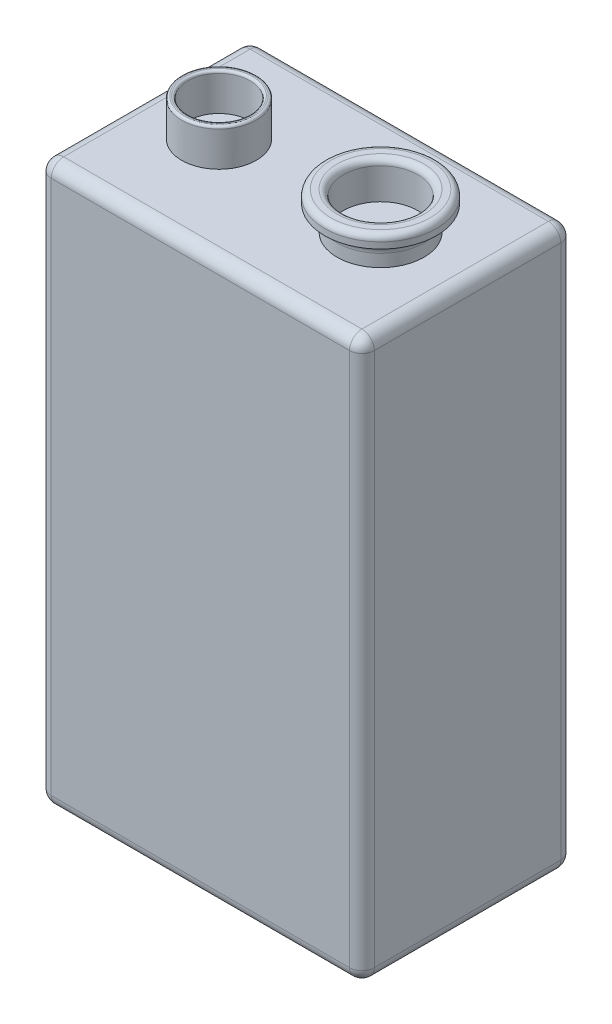
ISO-10303-21;
HEADER;
FILE_DESCRIPTION(('STEP AP214'),'2;1');
FILE_NAME('part.step','',(''),(''),'','','');
FILE_SCHEMA(('AUTOMOTIVE_DESIGN { 1 0 10303 214 1 1 1 1 }'));
ENDSEC;
DATA;
#1=APPLICATION_CONTEXT('core data for automotive mechanical design processes');
#2=APPLICATION_PROTOCOL_DEFINITION('international standard','automotive_design',2000,#1);
#3=PRODUCT_CONTEXT('',#1,'mechanical');
#4=PRODUCT('Part','Part','',(#3));
#5=PRODUCT_RELATED_PRODUCT_CATEGORY('part','',(#4));
#6=PRODUCT_DEFINITION_FORMATION('','',#4);
#7=PRODUCT_DEFINITION_CONTEXT('part definition',#1,'design');
#8=PRODUCT_DEFINITION('design','',#6,#7);
#9=PRODUCT_DEFINITION_SHAPE('','',#8);
#10=(LENGTH_UNIT() NAMED_UNIT(*) SI_UNIT(.MILLI.,.METRE.));
#11=(NAMED_UNIT(*) PLANE_ANGLE_UNIT() SI_UNIT($,.RADIAN.));
#12=(NAMED_UNIT(*) SI_UNIT($,.STERADIAN.) SOLID_ANGLE_UNIT());
#13=UNCERTAINTY_MEASURE_WITH_UNIT(LENGTH_MEASURE(1.E-05),#10,'distance_accuracy_value','');
#14=(GEOMETRIC_REPRESENTATION_CONTEXT(3) GLOBAL_UNCERTAINTY_ASSIGNED_CONTEXT((#13)) GLOBAL_UNIT_ASSIGNED_CONTEXT((#10,
#11,#12)) REPRESENTATION_CONTEXT('',''));
#15=CARTESIAN_POINT('',(0.,0.,0.));
#16=DIRECTION('',(0.,0.,1.));
#17=DIRECTION('',(1.,0.,0.));
#18=AXIS2_PLACEMENT_3D('',#15,#16,#17);
#19=CARTESIAN_POINT('',(0.,45.,0.));
#20=DIRECTION('',(0.,-1.,0.));
#21=DIRECTION('',(0.,0.,-1.));
#22=AXIS2_PLACEMENT_3D('',#19,#20,#21);
#23=PLANE('',#22);
#24=DIRECTION('',(0.,0.,-1.));
#25=VECTOR('',#24,1.);
#26=CARTESIAN_POINT('',(12.,45.,0.));
#27=LINE('',#26,#25);
#28=CARTESIAN_POINT('',(12.,45.,7.5));
#29=VERTEX_POINT('',#28);
#30=CARTESIAN_POINT('',(12.,45.,-7.5));
#31=VERTEX_POINT('',#30);
#32=EDGE_CURVE('E49',#29,#31,#27,.T.);
#33=ORIENTED_EDGE('',*,*,#32,.T.);
#34=DIRECTION('',(-1.,0.,0.));
#35=VECTOR('',#34,1.);
#36=CARTESIAN_POINT('',(0.,45.,-7.5));
#37=LINE('',#36,#35);
#38=CARTESIAN_POINT('',(-12.,45.,-7.5));
#39=VERTEX_POINT('',#38);
#40=EDGE_CURVE('E201',#31,#39,#37,.T.);
#41=ORIENTED_EDGE('',*,*,#40,.T.);
#42=DIRECTION('',(0.,0.,1.));
#43=VECTOR('',#42,1.);
#44=CARTESIAN_POINT('',(-12.,45.,0.));
#45=LINE('',#44,#43);
#46=CARTESIAN_POINT('',(-12.,45.,7.5));
#47=VERTEX_POINT('',#46);
#48=EDGE_CURVE('E197',#39,#47,#45,.T.);
#49=ORIENTED_EDGE('',*,*,#48,.T.);
#50=DIRECTION('',(1.,0.,0.));
#51=VECTOR('',#50,1.);
#52=CARTESIAN_POINT('',(0.,45.,7.5));
#53=LINE('',#52,#51);
#54=EDGE_CURVE('E54',#47,#29,#53,.T.);
#55=ORIENTED_EDGE('',*,*,#54,.T.);
#56=EDGE_LOOP('',(#33,#41,#49,#55));
#57=FACE_BOUND('',#56,.T.);
#58=CARTESIAN_POINT('',(-7.,45.,0.));
#59=DIRECTION('',(0.,-1.,0.));
#60=DIRECTION('',(0.,0.,-1.));
#61=AXIS2_PLACEMENT_3D('',#58,#59,#60);
#62=CIRCLE('',#61,3.);
#63=CARTESIAN_POINT('',(-7.,45.,-3.));
#64=VERTEX_POINT('',#63);
#65=EDGE_CURVE('E202',#64,#64,#62,.F.);
#66=ORIENTED_EDGE('',*,*,#65,.F.);
#67=EDGE_LOOP('',(#66));
#68=FACE_BOUND('',#67,.T.);
#69=CARTESIAN_POINT('',(5.99999999999999,45.,0.));
#70=DIRECTION('',(0.,-1.,0.));
#71=DIRECTION('',(0.,0.,-1.));
#72=AXIS2_PLACEMENT_3D('',#69,#70,#71);
#73=CIRCLE('',#72,3.5);
#74=CARTESIAN_POINT('',(5.99999999999999,45.,-3.5));
#75=VERTEX_POINT('',#74);
#76=EDGE_CURVE('E261',#75,#75,#73,.F.);
#77=ORIENTED_EDGE('',*,*,#76,.F.);
#78=EDGE_LOOP('',(#77));
#79=FACE_BOUND('',#78,.T.);
#80=ADVANCED_FACE('F34',(#57,#68,#79),#23,.F.);
#81=CARTESIAN_POINT('',(-13.,45.,-8.5));
#82=DIRECTION('',(1.,0.,0.));
#83=DIRECTION('',(0.,0.,-1.));
#84=AXIS2_PLACEMENT_3D('',#81,#82,#83);
#85=PLANE('',#84);
#86=DIRECTION('',(0.,0.,1.));
#87=VECTOR('',#86,1.);
#88=CARTESIAN_POINT('',(-13.,44.,-8.5));
#89=LINE('',#88,#87);
#90=CARTESIAN_POINT('',(-13.,44.,7.5));
#91=VERTEX_POINT('',#90);
#92=CARTESIAN_POINT('',(-13.,44.,-7.5));
#93=VERTEX_POINT('',#92);
#94=EDGE_CURVE('E190',#91,#93,#89,.F.);
#95=ORIENTED_EDGE('',*,*,#94,.T.);
#96=DIRECTION('',(0.,-1.,0.));
#97=VECTOR('',#96,1.);
#98=CARTESIAN_POINT('',(-13.,45.,-7.5));
#99=LINE('',#98,#97);
#100=CARTESIAN_POINT('',(-13.,1.,-7.5));
#101=VERTEX_POINT('',#100);
#102=EDGE_CURVE('E195',#93,#101,#99,.T.);
#103=ORIENTED_EDGE('',*,*,#102,.T.);
#104=DIRECTION('',(0.,0.,1.));
#105=VECTOR('',#104,1.);
#106=CARTESIAN_POINT('',(-13.,1.,8.5));
#107=LINE('',#106,#105);
#108=CARTESIAN_POINT('',(-13.,1.,7.5));
#109=VERTEX_POINT('',#108);
#110=EDGE_CURVE('E192',#101,#109,#107,.T.);
#111=ORIENTED_EDGE('',*,*,#110,.T.);
#112=DIRECTION('',(0.,-1.,0.));
#113=VECTOR('',#112,1.);
#114=CARTESIAN_POINT('',(-13.,45.,7.5));
#115=LINE('',#114,#113);
#116=EDGE_CURVE('E188',#109,#91,#115,.F.);
#117=ORIENTED_EDGE('',*,*,#116,.T.);
#118=EDGE_LOOP('',(#95,#103,#111,#117));
#119=FACE_BOUND('',#118,.T.);
#120=ADVANCED_FACE('F334',(#119),#85,.F.);
#121=CARTESIAN_POINT('',(13.,45.,8.5));
#122=DIRECTION('',(0.,0.,-1.));
#123=DIRECTION('',(-1.,0.,0.));
#124=AXIS2_PLACEMENT_3D('',#121,#122,#123);
#125=PLANE('',#124);
#126=DIRECTION('',(1.,0.,0.));
#127=VECTOR('',#126,1.);
#128=CARTESIAN_POINT('',(13.,44.,8.5));
#129=LINE('',#128,#127);
#130=CARTESIAN_POINT('',(12.,44.,8.5));
#131=VERTEX_POINT('',#130);
#132=CARTESIAN_POINT('',(-12.,44.,8.5));
#133=VERTEX_POINT('',#132);
#134=EDGE_CURVE('E152',#131,#133,#129,.F.);
#135=ORIENTED_EDGE('',*,*,#134,.T.);
#136=DIRECTION('',(0.,-1.,0.));
#137=VECTOR('',#136,1.);
#138=CARTESIAN_POINT('',(-12.,45.,8.5));
#139=LINE('',#138,#137);
#140=CARTESIAN_POINT('',(-12.,1.,8.5));
#141=VERTEX_POINT('',#140);
#142=EDGE_CURVE('E157',#133,#141,#139,.T.);
#143=ORIENTED_EDGE('',*,*,#142,.T.);
#144=DIRECTION('',(1.,0.,0.));
#145=VECTOR('',#144,1.);
#146=CARTESIAN_POINT('',(13.,1.,8.5));
#147=LINE('',#146,#145);
#148=CARTESIAN_POINT('',(12.,1.,8.5));
#149=VERTEX_POINT('',#148);
#150=EDGE_CURVE('E127',#141,#149,#147,.T.);
#151=ORIENTED_EDGE('',*,*,#150,.T.);
#152=DIRECTION('',(0.,-1.,0.));
#153=VECTOR('',#152,1.);
#154=CARTESIAN_POINT('',(12.,45.,8.5));
#155=LINE('',#154,#153);
#156=EDGE_CURVE('E146',#149,#131,#155,.F.);
#157=ORIENTED_EDGE('',*,*,#156,.T.);
#158=EDGE_LOOP('',(#135,#143,#151,#157));
#159=FACE_BOUND('',#158,.T.);
#160=ADVANCED_FACE('F155',(#159),#125,.F.);
#161=CARTESIAN_POINT('',(13.,45.,-8.5));
#162=DIRECTION('',(-1.,0.,0.));
#163=DIRECTION('',(0.,0.,1.));
#164=AXIS2_PLACEMENT_3D('',#161,#162,#163);
#165=PLANE('',#164);
#166=DIRECTION('',(0.,0.,-1.));
#167=VECTOR('',#166,1.);
#168=CARTESIAN_POINT('',(13.,1.,-8.5));
#169=LINE('',#168,#167);
#170=CARTESIAN_POINT('',(13.,1.,7.49999999999999));
#171=VERTEX_POINT('',#170);
#172=CARTESIAN_POINT('',(13.,1.,-7.5));
#173=VERTEX_POINT('',#172);
#174=EDGE_CURVE('E174',#171,#173,#169,.T.);
#175=ORIENTED_EDGE('',*,*,#174,.T.);
#176=DIRECTION('',(0.,-1.,0.));
#177=VECTOR('',#176,1.);
#178=CARTESIAN_POINT('',(13.,45.,-7.5));
#179=LINE('',#178,#177);
#180=CARTESIAN_POINT('',(13.,44.,-7.5));
#181=VERTEX_POINT('',#180);
#182=EDGE_CURVE('E177',#173,#181,#179,.F.);
#183=ORIENTED_EDGE('',*,*,#182,.T.);
#184=DIRECTION('',(0.,0.,-1.));
#185=VECTOR('',#184,1.);
#186=CARTESIAN_POINT('',(13.,44.,-8.5));
#187=LINE('',#186,#185);
#188=CARTESIAN_POINT('',(13.,44.,7.49999999999999));
#189=VERTEX_POINT('',#188);
#190=EDGE_CURVE('E172',#181,#189,#187,.F.);
#191=ORIENTED_EDGE('',*,*,#190,.T.);
#192=DIRECTION('',(0.,-1.,0.));
#193=VECTOR('',#192,1.);
#194=CARTESIAN_POINT('',(13.,45.,7.49999999999999));
#195=LINE('',#194,#193);
#196=EDGE_CURVE('E170',#189,#171,#195,.T.);
#197=ORIENTED_EDGE('',*,*,#196,.T.);
#198=EDGE_LOOP('',(#175,#183,#191,#197));
#199=FACE_BOUND('',#198,.T.);
#200=ADVANCED_FACE('F677',(#199),#165,.F.);
#201=CARTESIAN_POINT('',(13.,45.,-8.5));
#202=DIRECTION('',(0.,0.,1.));
#203=DIRECTION('',(1.,0.,0.));
#204=AXIS2_PLACEMENT_3D('',#201,#202,#203);
#205=PLANE('',#204);
#206=DIRECTION('',(-1.,0.,0.));
#207=VECTOR('',#206,1.);
#208=CARTESIAN_POINT('',(-13.,1.,-8.5));
#209=LINE('',#208,#207);
#210=CARTESIAN_POINT('',(12.,1.,-8.5));
#211=VERTEX_POINT('',#210);
#212=CARTESIAN_POINT('',(-12.,1.,-8.5));
#213=VERTEX_POINT('',#212);
#214=EDGE_CURVE('E183',#211,#213,#209,.T.);
#215=ORIENTED_EDGE('',*,*,#214,.T.);
#216=DIRECTION('',(0.,-1.,0.));
#217=VECTOR('',#216,1.);
#218=CARTESIAN_POINT('',(-12.,45.,-8.5));
#219=LINE('',#218,#217);
#220=CARTESIAN_POINT('',(-12.,44.,-8.5));
#221=VERTEX_POINT('',#220);
#222=EDGE_CURVE('E186',#213,#221,#219,.F.);
#223=ORIENTED_EDGE('',*,*,#222,.T.);
#224=DIRECTION('',(-1.,0.,0.));
#225=VECTOR('',#224,1.);
#226=CARTESIAN_POINT('',(13.,44.,-8.5));
#227=LINE('',#226,#225);
#228=CARTESIAN_POINT('',(12.,44.,-8.5));
#229=VERTEX_POINT('',#228);
#230=EDGE_CURVE('E181',#221,#229,#227,.F.);
#231=ORIENTED_EDGE('',*,*,#230,.T.);
#232=DIRECTION('',(0.,-1.,0.));
#233=VECTOR('',#232,1.);
#234=CARTESIAN_POINT('',(12.,45.,-8.5));
#235=LINE('',#234,#233);
#236=EDGE_CURVE('E179',#229,#211,#235,.T.);
#237=ORIENTED_EDGE('',*,*,#236,.T.);
#238=EDGE_LOOP('',(#215,#223,#231,#237));
#239=FACE_BOUND('',#238,.T.);
#240=ADVANCED_FACE('F667',(#239),#205,.F.);
#241=CARTESIAN_POINT('',(0.,0.,0.));
#242=DIRECTION('',(0.,-1.,0.));
#243=DIRECTION('',(0.,0.,-1.));
#244=AXIS2_PLACEMENT_3D('',#241,#242,#243);
#245=PLANE('',#244);
#246=DIRECTION('',(0.,0.,-1.));
#247=VECTOR('',#246,1.);
#248=CARTESIAN_POINT('',(12.,0.,8.5));
#249=LINE('',#248,#247);
#250=CARTESIAN_POINT('',(12.,0.,-7.5));
#251=VERTEX_POINT('',#250);
#252=CARTESIAN_POINT('',(12.,0.,7.5));
#253=VERTEX_POINT('',#252);
#254=EDGE_CURVE('E167',#251,#253,#249,.F.);
#255=ORIENTED_EDGE('',*,*,#254,.T.);
#256=DIRECTION('',(1.,0.,0.));
#257=VECTOR('',#256,1.);
#258=CARTESIAN_POINT('',(-13.,0.,7.5));
#259=LINE('',#258,#257);
#260=CARTESIAN_POINT('',(-12.,0.,7.5));
#261=VERTEX_POINT('',#260);
#262=EDGE_CURVE('E129',#253,#261,#259,.F.);
#263=ORIENTED_EDGE('',*,*,#262,.T.);
#264=DIRECTION('',(0.,0.,1.));
#265=VECTOR('',#264,1.);
#266=CARTESIAN_POINT('',(-12.,0.,-8.5));
#267=LINE('',#266,#265);
#268=CARTESIAN_POINT('',(-12.,0.,-7.5));
#269=VERTEX_POINT('',#268);
#270=EDGE_CURVE('E160',#261,#269,#267,.F.);
#271=ORIENTED_EDGE('',*,*,#270,.T.);
#272=DIRECTION('',(-1.,0.,0.));
#273=VECTOR('',#272,1.);
#274=CARTESIAN_POINT('',(13.,0.,-7.5));
#275=LINE('',#274,#273);
#276=EDGE_CURVE('E165',#269,#251,#275,.F.);
#277=ORIENTED_EDGE('',*,*,#276,.T.);
#278=EDGE_LOOP('',(#255,#263,#271,#277));
#279=FACE_BOUND('',#278,.T.);
#280=ADVANCED_FACE('F659',(#279),#245,.T.);
#281=CARTESIAN_POINT('',(0.,44.,-7.5));
#282=DIRECTION('',(-1.,0.,0.));
#283=DIRECTION('',(0.,0.,1.));
#284=AXIS2_PLACEMENT_3D('',#281,#282,#283);
#285=CYLINDRICAL_SURFACE('',#284,1.);
#286=CARTESIAN_POINT('',(-12.,44.,-7.5));
#287=DIRECTION('',(-1.,0.,0.));
#288=DIRECTION('',(0.,0.,1.));
#289=AXIS2_PLACEMENT_3D('',#286,#287,#288);
#290=CIRCLE('',#289,1.);
#291=EDGE_CURVE('E153',#39,#221,#290,.T.);
#292=ORIENTED_EDGE('',*,*,#291,.F.);
#293=ORIENTED_EDGE('',*,*,#40,.F.);
#294=CARTESIAN_POINT('',(12.,44.,-7.5));
#295=DIRECTION('',(1.,0.,0.));
#296=DIRECTION('',(0.,0.,-1.));
#297=AXIS2_PLACEMENT_3D('',#294,#295,#296);
#298=CIRCLE('',#297,1.);
#299=EDGE_CURVE('E254',#229,#31,#298,.T.);
#300=ORIENTED_EDGE('',*,*,#299,.F.);
#301=ORIENTED_EDGE('',*,*,#230,.F.);
#302=EDGE_LOOP('',(#292,#293,#300,#301));
#303=FACE_BOUND('',#302,.T.);
#304=ADVANCED_FACE('F649',(#303),#285,.T.);
#305=CARTESIAN_POINT('',(-12.,44.,-7.5));
#306=DIRECTION('',(0.,0.,1.));
#307=DIRECTION('',(1.,0.,0.));
#308=AXIS2_PLACEMENT_3D('',#305,#306,#307);
#309=SPHERICAL_SURFACE('',#308,1.);
#310=CARTESIAN_POINT('',(-12.,44.,-7.5));
#311=DIRECTION('',(0.,0.,-1.));
#312=DIRECTION('',(0.,1.,0.));
#313=AXIS2_PLACEMENT_3D('',#310,#311,#312);
#314=CIRCLE('',#313,1.);
#315=EDGE_CURVE('E248',#39,#93,#314,.F.);
#316=ORIENTED_EDGE('',*,*,#315,.F.);
#317=ORIENTED_EDGE('',*,*,#291,.T.);
#318=CARTESIAN_POINT('',(-12.,44.,-7.5));
#319=DIRECTION('',(0.,1.,0.));
#320=DIRECTION('',(0.,0.,1.));
#321=AXIS2_PLACEMENT_3D('',#318,#319,#320);
#322=CIRCLE('',#321,1.);
#323=EDGE_CURVE('E251',#93,#221,#322,.F.);
#324=ORIENTED_EDGE('',*,*,#323,.F.);
#325=EDGE_LOOP('',(#316,#317,#324));
#326=FACE_BOUND('',#325,.T.);
#327=ADVANCED_FACE('F639',(#326),#309,.T.);
#328=CARTESIAN_POINT('',(12.,44.,-7.5));
#329=DIRECTION('',(0.,0.,1.));
#330=DIRECTION('',(1.,0.,0.));
#331=AXIS2_PLACEMENT_3D('',#328,#329,#330);
#332=SPHERICAL_SURFACE('',#331,1.);
#333=CARTESIAN_POINT('',(12.,44.,-7.5));
#334=DIRECTION('',(0.,1.,0.));
#335=DIRECTION('',(0.,0.,1.));
#336=AXIS2_PLACEMENT_3D('',#333,#334,#335);
#337=CIRCLE('',#336,1.);
#338=EDGE_CURVE('E242',#229,#181,#337,.F.);
#339=ORIENTED_EDGE('',*,*,#338,.F.);
#340=ORIENTED_EDGE('',*,*,#299,.T.);
#341=CARTESIAN_POINT('',(12.,44.,-7.5));
#342=DIRECTION('',(0.,0.,-1.));
#343=DIRECTION('',(-1.,0.,0.));
#344=AXIS2_PLACEMENT_3D('',#341,#342,#343);
#345=CIRCLE('',#344,1.);
#346=EDGE_CURVE('E245',#181,#31,#345,.F.);
#347=ORIENTED_EDGE('',*,*,#346,.F.);
#348=EDGE_LOOP('',(#339,#340,#347));
#349=FACE_BOUND('',#348,.T.);
#350=ADVANCED_FACE('F629',(#349),#332,.T.);
#351=CARTESIAN_POINT('',(-12.,45.,-7.5));
#352=DIRECTION('',(0.,-1.,0.));
#353=DIRECTION('',(0.,0.,-1.));
#354=AXIS2_PLACEMENT_3D('',#351,#352,#353);
#355=CYLINDRICAL_SURFACE('',#354,1.);
#356=ORIENTED_EDGE('',*,*,#323,.T.);
#357=ORIENTED_EDGE('',*,*,#222,.F.);
#358=CARTESIAN_POINT('',(-12.,1.,-7.5));
#359=DIRECTION('',(0.,-1.,0.));
#360=DIRECTION('',(0.,0.,-1.));
#361=AXIS2_PLACEMENT_3D('',#358,#359,#360);
#362=CIRCLE('',#361,1.);
#363=EDGE_CURVE('E237',#101,#213,#362,.T.);
#364=ORIENTED_EDGE('',*,*,#363,.F.);
#365=ORIENTED_EDGE('',*,*,#102,.F.);
#366=EDGE_LOOP('',(#356,#357,#364,#365));
#367=FACE_BOUND('',#366,.T.);
#368=ADVANCED_FACE('F619',(#367),#355,.T.);
#369=CARTESIAN_POINT('',(-12.,44.,0.));
#370=DIRECTION('',(0.,0.,1.));
#371=DIRECTION('',(1.,0.,0.));
#372=AXIS2_PLACEMENT_3D('',#369,#370,#371);
#373=CYLINDRICAL_SURFACE('',#372,1.);
#374=ORIENTED_EDGE('',*,*,#315,.T.);
#375=ORIENTED_EDGE('',*,*,#94,.F.);
#376=CARTESIAN_POINT('',(-12.,44.,7.5));
#377=DIRECTION('',(0.,0.,1.));
#378=DIRECTION('',(1.,0.,0.));
#379=AXIS2_PLACEMENT_3D('',#376,#377,#378);
#380=CIRCLE('',#379,1.);
#381=EDGE_CURVE('E234',#47,#91,#380,.T.);
#382=ORIENTED_EDGE('',*,*,#381,.F.);
#383=ORIENTED_EDGE('',*,*,#48,.F.);
#384=EDGE_LOOP('',(#374,#375,#382,#383));
#385=FACE_BOUND('',#384,.T.);
#386=ADVANCED_FACE('F608',(#385),#373,.T.);
#387=CARTESIAN_POINT('',(0.,44.,7.5));
#388=DIRECTION('',(1.,0.,0.));
#389=DIRECTION('',(0.,0.,-1.));
#390=AXIS2_PLACEMENT_3D('',#387,#388,#389);
#391=CYLINDRICAL_SURFACE('',#390,1.);
#392=CARTESIAN_POINT('',(12.,44.,7.5));
#393=DIRECTION('',(1.,0.,0.));
#394=DIRECTION('',(0.,0.,-1.));
#395=AXIS2_PLACEMENT_3D('',#392,#393,#394);
#396=CIRCLE('',#395,1.);
#397=EDGE_CURVE('E228',#29,#131,#396,.T.);
#398=ORIENTED_EDGE('',*,*,#397,.F.);
#399=ORIENTED_EDGE('',*,*,#54,.F.);
#400=CARTESIAN_POINT('',(-12.,44.,7.5));
#401=DIRECTION('',(-1.,0.,0.));
#402=DIRECTION('',(0.,-1.,0.));
#403=AXIS2_PLACEMENT_3D('',#400,#401,#402);
#404=CIRCLE('',#403,1.);
#405=EDGE_CURVE('E231',#133,#47,#404,.T.);
#406=ORIENTED_EDGE('',*,*,#405,.F.);
#407=ORIENTED_EDGE('',*,*,#134,.F.);
#408=EDGE_LOOP('',(#398,#399,#406,#407));
#409=FACE_BOUND('',#408,.T.);
#410=ADVANCED_FACE('F597',(#409),#391,.T.);
#411=CARTESIAN_POINT('',(12.,44.,0.));
#412=DIRECTION('',(0.,0.,-1.));
#413=DIRECTION('',(-1.,0.,0.));
#414=AXIS2_PLACEMENT_3D('',#411,#412,#413);
#415=CYLINDRICAL_SURFACE('',#414,1.);
#416=ORIENTED_EDGE('',*,*,#346,.T.);
#417=ORIENTED_EDGE('',*,*,#32,.F.);
#418=CARTESIAN_POINT('',(12.,44.,7.49999999999999));
#419=DIRECTION('',(0.,0.,1.));
#420=DIRECTION('',(0.,-1.,0.));
#421=AXIS2_PLACEMENT_3D('',#418,#419,#420);
#422=CIRCLE('',#421,1.);
#423=EDGE_CURVE('E225',#189,#29,#422,.T.);
#424=ORIENTED_EDGE('',*,*,#423,.F.);
#425=ORIENTED_EDGE('',*,*,#190,.F.);
#426=EDGE_LOOP('',(#416,#417,#424,#425));
#427=FACE_BOUND('',#426,.T.);
#428=ADVANCED_FACE('F585',(#427),#415,.T.);
#429=CARTESIAN_POINT('',(12.,45.,-7.5));
#430=DIRECTION('',(0.,-1.,0.));
#431=DIRECTION('',(0.,0.,-1.));
#432=AXIS2_PLACEMENT_3D('',#429,#430,#431);
#433=CYLINDRICAL_SURFACE('',#432,1.);
#434=ORIENTED_EDGE('',*,*,#338,.T.);
#435=ORIENTED_EDGE('',*,*,#182,.F.);
#436=CARTESIAN_POINT('',(12.,1.,-7.5));
#437=DIRECTION('',(0.,-1.,0.));
#438=DIRECTION('',(0.,0.,-1.));
#439=AXIS2_PLACEMENT_3D('',#436,#437,#438);
#440=CIRCLE('',#439,1.);
#441=EDGE_CURVE('E222',#211,#173,#440,.T.);
#442=ORIENTED_EDGE('',*,*,#441,.F.);
#443=ORIENTED_EDGE('',*,*,#236,.F.);
#444=EDGE_LOOP('',(#434,#435,#442,#443));
#445=FACE_BOUND('',#444,.T.);
#446=ADVANCED_FACE('F575',(#445),#433,.T.);
#447=CARTESIAN_POINT('',(13.,1.,-7.5));
#448=DIRECTION('',(1.,0.,0.));
#449=DIRECTION('',(0.,0.,-1.));
#450=AXIS2_PLACEMENT_3D('',#447,#448,#449);
#451=CYLINDRICAL_SURFACE('',#450,1.);
#452=CARTESIAN_POINT('',(-12.,1.,-7.5));
#453=DIRECTION('',(-1.,0.,0.));
#454=DIRECTION('',(0.,0.,1.));
#455=AXIS2_PLACEMENT_3D('',#452,#453,#454);
#456=CIRCLE('',#455,1.);
#457=EDGE_CURVE('E239',#213,#269,#456,.T.);
#458=ORIENTED_EDGE('',*,*,#457,.F.);
#459=ORIENTED_EDGE('',*,*,#214,.F.);
#460=CARTESIAN_POINT('',(12.,1.,-7.5));
#461=DIRECTION('',(1.,0.,0.));
#462=DIRECTION('',(0.,0.,-1.));
#463=AXIS2_PLACEMENT_3D('',#460,#461,#462);
#464=CIRCLE('',#463,1.);
#465=EDGE_CURVE('E219',#251,#211,#464,.T.);
#466=ORIENTED_EDGE('',*,*,#465,.F.);
#467=ORIENTED_EDGE('',*,*,#276,.F.);
#468=EDGE_LOOP('',(#458,#459,#466,#467));
#469=FACE_BOUND('',#468,.T.);
#470=ADVANCED_FACE('F565',(#469),#451,.T.);
#471=CARTESIAN_POINT('',(-12.,1.,-7.5));
#472=DIRECTION('',(0.,0.,1.));
#473=DIRECTION('',(1.,0.,0.));
#474=AXIS2_PLACEMENT_3D('',#471,#472,#473);
#475=SPHERICAL_SURFACE('',#474,1.);
#476=ORIENTED_EDGE('',*,*,#363,.T.);
#477=ORIENTED_EDGE('',*,*,#457,.T.);
#478=CARTESIAN_POINT('',(-12.,1.,-7.5));
#479=DIRECTION('',(0.,0.,-1.));
#480=DIRECTION('',(-1.,0.,0.));
#481=AXIS2_PLACEMENT_3D('',#478,#479,#480);
#482=CIRCLE('',#481,1.);
#483=EDGE_CURVE('E216',#101,#269,#482,.F.);
#484=ORIENTED_EDGE('',*,*,#483,.F.);
#485=EDGE_LOOP('',(#476,#477,#484));
#486=FACE_BOUND('',#485,.T.);
#487=ADVANCED_FACE('F553',(#486),#475,.T.);
#488=CARTESIAN_POINT('',(-12.,44.,7.5));
#489=DIRECTION('',(0.,0.,1.));
#490=DIRECTION('',(1.,0.,0.));
#491=AXIS2_PLACEMENT_3D('',#488,#489,#490);
#492=SPHERICAL_SURFACE('',#491,1.);
#493=ORIENTED_EDGE('',*,*,#405,.T.);
#494=ORIENTED_EDGE('',*,*,#381,.T.);
#495=CARTESIAN_POINT('',(-12.,44.,7.5));
#496=DIRECTION('',(0.,1.,0.));
#497=DIRECTION('',(0.,0.,1.));
#498=AXIS2_PLACEMENT_3D('',#495,#496,#497);
#499=CIRCLE('',#498,1.);
#500=EDGE_CURVE('E213',#133,#91,#499,.F.);
#501=ORIENTED_EDGE('',*,*,#500,.F.);
#502=EDGE_LOOP('',(#493,#494,#501));
#503=FACE_BOUND('',#502,.T.);
#504=ADVANCED_FACE('F542',(#503),#492,.T.);
#505=CARTESIAN_POINT('',(12.,44.,7.5));
#506=DIRECTION('',(0.,0.,1.));
#507=DIRECTION('',(1.,0.,0.));
#508=AXIS2_PLACEMENT_3D('',#505,#506,#507);
#509=SPHERICAL_SURFACE('',#508,1.);
#510=ORIENTED_EDGE('',*,*,#423,.T.);
#511=ORIENTED_EDGE('',*,*,#397,.T.);
#512=CARTESIAN_POINT('',(12.,44.,7.5));
#513=DIRECTION('',(0.,1.,0.));
#514=DIRECTION('',(0.,0.,1.));
#515=AXIS2_PLACEMENT_3D('',#512,#513,#514);
#516=CIRCLE('',#515,1.);
#517=EDGE_CURVE('E149',#189,#131,#516,.F.);
#518=ORIENTED_EDGE('',*,*,#517,.F.);
#519=EDGE_LOOP('',(#510,#511,#518));
#520=FACE_BOUND('',#519,.T.);
#521=ADVANCED_FACE('F531',(#520),#509,.T.);
#522=CARTESIAN_POINT('',(12.,1.,-7.5));
#523=DIRECTION('',(0.,0.,1.));
#524=DIRECTION('',(1.,0.,0.));
#525=AXIS2_PLACEMENT_3D('',#522,#523,#524);
#526=SPHERICAL_SURFACE('',#525,1.);
#527=ORIENTED_EDGE('',*,*,#465,.T.);
#528=ORIENTED_EDGE('',*,*,#441,.T.);
#529=CARTESIAN_POINT('',(12.,1.,-7.5));
#530=DIRECTION('',(0.,0.,-1.));
#531=DIRECTION('',(-1.,0.,0.));
#532=AXIS2_PLACEMENT_3D('',#529,#530,#531);
#533=CIRCLE('',#532,1.);
#534=EDGE_CURVE('E210',#251,#173,#533,.F.);
#535=ORIENTED_EDGE('',*,*,#534,.F.);
#536=EDGE_LOOP('',(#527,#528,#535));
#537=FACE_BOUND('',#536,.T.);
#538=ADVANCED_FACE('F520',(#537),#526,.T.);
#539=CARTESIAN_POINT('',(-12.,1.,-8.5));
#540=DIRECTION('',(0.,0.,-1.));
#541=DIRECTION('',(-1.,0.,0.));
#542=AXIS2_PLACEMENT_3D('',#539,#540,#541);
#543=CYLINDRICAL_SURFACE('',#542,1.);
#544=ORIENTED_EDGE('',*,*,#483,.T.);
#545=ORIENTED_EDGE('',*,*,#270,.F.);
#546=CARTESIAN_POINT('',(-12.,1.,7.5));
#547=DIRECTION('',(0.,0.,1.));
#548=DIRECTION('',(1.,0.,0.));
#549=AXIS2_PLACEMENT_3D('',#546,#547,#548);
#550=CIRCLE('',#549,1.);
#551=EDGE_CURVE('E207',#109,#261,#550,.T.);
#552=ORIENTED_EDGE('',*,*,#551,.F.);
#553=ORIENTED_EDGE('',*,*,#110,.F.);
#554=EDGE_LOOP('',(#544,#545,#552,#553));
#555=FACE_BOUND('',#554,.T.);
#556=ADVANCED_FACE('F508',(#555),#543,.T.);
#557=CARTESIAN_POINT('',(-12.,45.,7.5));
#558=DIRECTION('',(0.,-1.,0.));
#559=DIRECTION('',(0.,0.,-1.));
#560=AXIS2_PLACEMENT_3D('',#557,#558,#559);
#561=CYLINDRICAL_SURFACE('',#560,1.);
#562=ORIENTED_EDGE('',*,*,#500,.T.);
#563=ORIENTED_EDGE('',*,*,#116,.F.);
#564=CARTESIAN_POINT('',(-12.,1.,7.5));
#565=DIRECTION('',(0.,-1.,0.));
#566=DIRECTION('',(0.,0.,-1.));
#567=AXIS2_PLACEMENT_3D('',#564,#565,#566);
#568=CIRCLE('',#567,1.);
#569=EDGE_CURVE('E143',#141,#109,#568,.T.);
#570=ORIENTED_EDGE('',*,*,#569,.F.);
#571=ORIENTED_EDGE('',*,*,#142,.F.);
#572=EDGE_LOOP('',(#562,#563,#570,#571));
#573=FACE_BOUND('',#572,.T.);
#574=ADVANCED_FACE('F498',(#573),#561,.T.);
#575=CARTESIAN_POINT('',(12.,45.,7.49999999999999));
#576=DIRECTION('',(0.,-1.,0.));
#577=DIRECTION('',(0.,0.,-1.));
#578=AXIS2_PLACEMENT_3D('',#575,#576,#577);
#579=CYLINDRICAL_SURFACE('',#578,1.);
#580=ORIENTED_EDGE('',*,*,#517,.T.);
#581=ORIENTED_EDGE('',*,*,#156,.F.);
#582=CARTESIAN_POINT('',(12.,1.,7.49999999999999));
#583=DIRECTION('',(0.,-1.,0.));
#584=DIRECTION('',(0.,0.,-1.));
#585=AXIS2_PLACEMENT_3D('',#582,#583,#584);
#586=CIRCLE('',#585,1.);
#587=EDGE_CURVE('E136',#171,#149,#586,.T.);
#588=ORIENTED_EDGE('',*,*,#587,.F.);
#589=ORIENTED_EDGE('',*,*,#196,.F.);
#590=EDGE_LOOP('',(#580,#581,#588,#589));
#591=FACE_BOUND('',#590,.T.);
#592=ADVANCED_FACE('F147',(#591),#579,.T.);
#593=CARTESIAN_POINT('',(12.,1.,-8.5));
#594=DIRECTION('',(0.,0.,1.));
#595=DIRECTION('',(1.,0.,0.));
#596=AXIS2_PLACEMENT_3D('',#593,#594,#595);
#597=CYLINDRICAL_SURFACE('',#596,1.);
#598=ORIENTED_EDGE('',*,*,#534,.T.);
#599=ORIENTED_EDGE('',*,*,#174,.F.);
#600=CARTESIAN_POINT('',(12.,1.,7.5));
#601=DIRECTION('',(0.,0.,1.));
#602=DIRECTION('',(1.,0.,0.));
#603=AXIS2_PLACEMENT_3D('',#600,#601,#602);
#604=CIRCLE('',#603,1.);
#605=EDGE_CURVE('E140',#253,#171,#604,.T.);
#606=ORIENTED_EDGE('',*,*,#605,.F.);
#607=ORIENTED_EDGE('',*,*,#254,.F.);
#608=EDGE_LOOP('',(#598,#599,#606,#607));
#609=FACE_BOUND('',#608,.T.);
#610=ADVANCED_FACE('F477',(#609),#597,.T.);
#611=CARTESIAN_POINT('',(-12.,1.,7.5));
#612=DIRECTION('',(0.,0.,1.));
#613=DIRECTION('',(1.,0.,0.));
#614=AXIS2_PLACEMENT_3D('',#611,#612,#613);
#615=SPHERICAL_SURFACE('',#614,1.);
#616=ORIENTED_EDGE('',*,*,#569,.T.);
#617=ORIENTED_EDGE('',*,*,#551,.T.);
#618=CARTESIAN_POINT('',(-12.,1.,7.5));
#619=DIRECTION('',(-1.,0.,0.));
#620=DIRECTION('',(0.,0.,1.));
#621=AXIS2_PLACEMENT_3D('',#618,#619,#620);
#622=CIRCLE('',#621,1.);
#623=EDGE_CURVE('E132',#141,#261,#622,.F.);
#624=ORIENTED_EDGE('',*,*,#623,.F.);
#625=EDGE_LOOP('',(#616,#617,#624));
#626=FACE_BOUND('',#625,.T.);
#627=ADVANCED_FACE('F466',(#626),#615,.T.);
#628=CARTESIAN_POINT('',(12.,1.,7.5));
#629=DIRECTION('',(0.,0.,1.));
#630=DIRECTION('',(1.,0.,0.));
#631=AXIS2_PLACEMENT_3D('',#628,#629,#630);
#632=SPHERICAL_SURFACE('',#631,1.);
#633=ORIENTED_EDGE('',*,*,#605,.T.);
#634=ORIENTED_EDGE('',*,*,#587,.T.);
#635=CARTESIAN_POINT('',(12.,1.,7.5));
#636=DIRECTION('',(1.,0.,0.));
#637=DIRECTION('',(0.,0.,-1.));
#638=AXIS2_PLACEMENT_3D('',#635,#636,#637);
#639=CIRCLE('',#638,1.);
#640=EDGE_CURVE('E123',#253,#149,#639,.F.);
#641=ORIENTED_EDGE('',*,*,#640,.F.);
#642=EDGE_LOOP('',(#633,#634,#641));
#643=FACE_BOUND('',#642,.T.);
#644=ADVANCED_FACE('F138',(#643),#632,.T.);
#645=CARTESIAN_POINT('',(13.,1.,7.5));
#646=DIRECTION('',(-1.,0.,0.));
#647=DIRECTION('',(0.,0.,1.));
#648=AXIS2_PLACEMENT_3D('',#645,#646,#647);
#649=CYLINDRICAL_SURFACE('',#648,1.);
#650=ORIENTED_EDGE('',*,*,#623,.T.);
#651=ORIENTED_EDGE('',*,*,#262,.F.);
#652=ORIENTED_EDGE('',*,*,#640,.T.);
#653=ORIENTED_EDGE('',*,*,#150,.F.);
#654=EDGE_LOOP('',(#650,#651,#652,#653));
#655=FACE_BOUND('',#654,.T.);
#656=ADVANCED_FACE('F125',(#655),#649,.T.);
#657=CARTESIAN_POINT('',(-7.,48.,0.));
#658=DIRECTION('',(0.,1.,0.));
#659=DIRECTION('',(0.,0.,1.));
#660=AXIS2_PLACEMENT_3D('',#657,#658,#659);
#661=PLANE('',#660);
#662=CARTESIAN_POINT('',(-7.,48.,0.));
#663=DIRECTION('',(0.,1.,0.));
#664=DIRECTION('',(0.,0.,1.));
#665=AXIS2_PLACEMENT_3D('',#662,#663,#664);
#666=CIRCLE('',#665,2.7);
#667=CARTESIAN_POINT('',(-7.,48.,2.7));
#668=VERTEX_POINT('',#667);
#669=EDGE_CURVE('E42',#668,#668,#666,.F.);
#670=ORIENTED_EDGE('',*,*,#669,.T.);
#671=EDGE_LOOP('',(#670));
#672=FACE_BOUND('',#671,.T.);
#673=CARTESIAN_POINT('',(-7.,48.,0.));
#674=DIRECTION('',(0.,1.,0.));
#675=DIRECTION('',(0.,0.,1.));
#676=AXIS2_PLACEMENT_3D('',#673,#674,#675);
#677=CIRCLE('',#676,2.8);
#678=CARTESIAN_POINT('',(-7.,48.,2.8));
#679=VERTEX_POINT('',#678);
#680=EDGE_CURVE('E282',#679,#679,#677,.T.);
#681=ORIENTED_EDGE('',*,*,#680,.T.);
#682=EDGE_LOOP('',(#681));
#683=FACE_BOUND('',#682,.T.);
#684=ADVANCED_FACE('F287',(#672,#683),#661,.T.);
#685=CARTESIAN_POINT('',(-7.,48.,0.));
#686=DIRECTION('',(0.,-1.,0.));
#687=DIRECTION('',(0.,0.,-1.));
#688=AXIS2_PLACEMENT_3D('',#685,#686,#687);
#689=CYLINDRICAL_SURFACE('',#688,3.);
#690=CARTESIAN_POINT('',(-7.,47.8,0.));
#691=DIRECTION('',(0.,1.,0.));
#692=DIRECTION('',(0.,0.,1.));
#693=AXIS2_PLACEMENT_3D('',#690,#691,#692);
#694=CIRCLE('',#693,3.);
#695=CARTESIAN_POINT('',(-7.,47.8,3.));
#696=VERTEX_POINT('',#695);
#697=EDGE_CURVE('E11',#696,#696,#694,.F.);
#698=ORIENTED_EDGE('',*,*,#697,.T.);
#699=EDGE_LOOP('',(#698));
#700=FACE_BOUND('',#699,.T.);
#701=ORIENTED_EDGE('',*,*,#65,.T.);
#702=EDGE_LOOP('',(#701));
#703=FACE_BOUND('',#702,.T.);
#704=ADVANCED_FACE('F300',(#700,#703),#689,.T.);
#705=CARTESIAN_POINT('',(-7.,48.,0.));
#706=DIRECTION('',(0.,-1.,0.));
#707=DIRECTION('',(0.,0.,-1.));
#708=AXIS2_PLACEMENT_3D('',#705,#706,#707);
#709=CYLINDRICAL_SURFACE('',#708,2.5);
#710=CARTESIAN_POINT('',(-7.,47.8,0.));
#711=DIRECTION('',(0.,1.,0.));
#712=DIRECTION('',(0.,0.,1.));
#713=AXIS2_PLACEMENT_3D('',#710,#711,#712);
#714=CIRCLE('',#713,2.5);
#715=CARTESIAN_POINT('',(-7.,47.8,2.5));
#716=VERTEX_POINT('',#715);
#717=EDGE_CURVE('E279',#716,#716,#714,.T.);
#718=ORIENTED_EDGE('',*,*,#717,.T.);
#719=EDGE_LOOP('',(#718));
#720=FACE_BOUND('',#719,.T.);
#721=CARTESIAN_POINT('',(-7.,45.,0.));
#722=DIRECTION('',(0.,1.,0.));
#723=DIRECTION('',(0.,0.,1.));
#724=AXIS2_PLACEMENT_3D('',#721,#722,#723);
#725=CIRCLE('',#724,2.5);
#726=CARTESIAN_POINT('',(-7.,45.,2.5));
#727=VERTEX_POINT('',#726);
#728=EDGE_CURVE('E133',#727,#727,#725,.T.);
#729=ORIENTED_EDGE('',*,*,#728,.F.);
#730=EDGE_LOOP('',(#729));
#731=FACE_BOUND('',#730,.T.);
#732=ADVANCED_FACE('F296',(#720,#731),#709,.F.);
#733=ORIENTED_EDGE('',*,*,#728,.T.);
#734=EDGE_LOOP('',(#733));
#735=FACE_BOUND('',#734,.T.);
#736=ADVANCED_FACE('F299',(#735),#23,.F.);
#737=CARTESIAN_POINT('',(5.99999999999999,47.,0.));
#738=DIRECTION('',(0.,-1.,0.));
#739=DIRECTION('',(0.,0.,-1.));
#740=AXIS2_PLACEMENT_3D('',#737,#738,#739);
#741=CYLINDRICAL_SURFACE('',#740,3.5);
#742=CARTESIAN_POINT('',(5.99999999999999,46.,0.));
#743=DIRECTION('',(0.,1.,0.));
#744=DIRECTION('',(0.,0.,1.));
#745=AXIS2_PLACEMENT_3D('',#742,#743,#744);
#746=CIRCLE('',#745,3.5);
#747=CARTESIAN_POINT('',(5.99999999999999,46.,3.5));
#748=VERTEX_POINT('',#747);
#749=EDGE_CURVE('E264',#748,#748,#746,.F.);
#750=ORIENTED_EDGE('',*,*,#749,.T.);
#751=EDGE_LOOP('',(#750));
#752=FACE_BOUND('',#751,.T.);
#753=ORIENTED_EDGE('',*,*,#76,.T.);
#754=EDGE_LOOP('',(#753));
#755=FACE_BOUND('',#754,.T.);
#756=ADVANCED_FACE('F347',(#752,#755),#741,.T.);
#757=CARTESIAN_POINT('',(5.99999999999999,48.,0.));
#758=DIRECTION('',(0.,1.,0.));
#759=DIRECTION('',(0.,0.,1.));
#760=AXIS2_PLACEMENT_3D('',#757,#758,#759);
#761=PLANE('',#760);
#762=CARTESIAN_POINT('',(5.99999999999999,48.,0.));
#763=DIRECTION('',(0.,1.,0.));
#764=DIRECTION('',(0.,0.,1.));
#765=AXIS2_PLACEMENT_3D('',#762,#763,#764);
#766=CIRCLE('',#765,3.5);
#767=CARTESIAN_POINT('',(5.99999999999999,48.,3.5));
#768=VERTEX_POINT('',#767);
#769=EDGE_CURVE('E273',#768,#768,#766,.F.);
#770=ORIENTED_EDGE('',*,*,#769,.T.);
#771=EDGE_LOOP('',(#770));
#772=FACE_BOUND('',#771,.T.);
#773=CARTESIAN_POINT('',(5.99999999999999,48.,0.));
#774=DIRECTION('',(0.,1.,0.));
#775=DIRECTION('',(0.,0.,1.));
#776=AXIS2_PLACEMENT_3D('',#773,#774,#775);
#777=CIRCLE('',#776,4.);
#778=CARTESIAN_POINT('',(5.99999999999999,48.,4.));
#779=VERTEX_POINT('',#778);
#780=EDGE_CURVE('E270',#779,#779,#777,.T.);
#781=ORIENTED_EDGE('',*,*,#780,.T.);
#782=EDGE_LOOP('',(#781));
#783=FACE_BOUND('',#782,.T.);
#784=ADVANCED_FACE('F351',(#772,#783),#761,.T.);
#785=CARTESIAN_POINT('',(5.99999999999999,48.,0.));
#786=DIRECTION('',(0.,-1.,0.));
#787=DIRECTION('',(0.,0.,-1.));
#788=AXIS2_PLACEMENT_3D('',#785,#786,#787);
#789=CYLINDRICAL_SURFACE('',#788,4.5);
#790=CARTESIAN_POINT('',(5.99999999999999,47.5,0.));
#791=DIRECTION('',(0.,1.,0.));
#792=DIRECTION('',(0.,0.,1.));
#793=AXIS2_PLACEMENT_3D('',#790,#791,#792);
#794=CIRCLE('',#793,4.5);
#795=CARTESIAN_POINT('',(5.99999999999999,47.5,4.5));
#796=VERTEX_POINT('',#795);
#797=EDGE_CURVE('E276',#796,#796,#794,.F.);
#798=ORIENTED_EDGE('',*,*,#797,.T.);
#799=EDGE_LOOP('',(#798));
#800=FACE_BOUND('',#799,.T.);
#801=CARTESIAN_POINT('',(5.99999999999999,47.,0.));
#802=DIRECTION('',(0.,1.,0.));
#803=DIRECTION('',(0.,0.,1.));
#804=AXIS2_PLACEMENT_3D('',#801,#802,#803);
#805=CIRCLE('',#804,4.5);
#806=CARTESIAN_POINT('',(5.99999999999999,47.,4.5));
#807=VERTEX_POINT('',#806);
#808=EDGE_CURVE('E308',#807,#807,#805,.T.);
#809=ORIENTED_EDGE('',*,*,#808,.T.);
#810=EDGE_LOOP('',(#809));
#811=FACE_BOUND('',#810,.T.);
#812=ADVANCED_FACE('F314',(#800,#811),#789,.T.);
#813=CARTESIAN_POINT('',(5.99999999999999,45.,0.));
#814=DIRECTION('',(0.,1.,0.));
#815=DIRECTION('',(0.,0.,1.));
#816=AXIS2_PLACEMENT_3D('',#813,#814,#815);
#817=CIRCLE('',#816,3.);
#818=CARTESIAN_POINT('',(5.99999999999999,45.,3.));
#819=VERTEX_POINT('',#818);
#820=EDGE_CURVE('E305',#819,#819,#817,.T.);
#821=ORIENTED_EDGE('',*,*,#820,.T.);
#822=EDGE_LOOP('',(#821));
#823=FACE_BOUND('',#822,.T.);
#824=ADVANCED_FACE('F328',(#823),#23,.F.);
#825=CARTESIAN_POINT('',(5.99999999999999,47.,0.));
#826=DIRECTION('',(0.,-1.,0.));
#827=DIRECTION('',(0.,0.,-1.));
#828=AXIS2_PLACEMENT_3D('',#825,#826,#827);
#829=CYLINDRICAL_SURFACE('',#828,3.);
#830=CARTESIAN_POINT('',(5.99999999999999,47.5,0.));
#831=DIRECTION('',(0.,1.,0.));
#832=DIRECTION('',(0.,0.,1.));
#833=AXIS2_PLACEMENT_3D('',#830,#831,#832);
#834=CIRCLE('',#833,3.);
#835=CARTESIAN_POINT('',(5.99999999999999,47.5,3.));
#836=VERTEX_POINT('',#835);
#837=EDGE_CURVE('E267',#836,#836,#834,.T.);
#838=ORIENTED_EDGE('',*,*,#837,.T.);
#839=EDGE_LOOP('',(#838));
#840=FACE_BOUND('',#839,.T.);
#841=ORIENTED_EDGE('',*,*,#820,.F.);
#842=EDGE_LOOP('',(#841));
#843=FACE_BOUND('',#842,.T.);
#844=ADVANCED_FACE('F319',(#840,#843),#829,.F.);
#845=CARTESIAN_POINT('',(5.99999999999999,46.,0.));
#846=DIRECTION('',(0.,1.,0.));
#847=DIRECTION('',(0.,0.,1.));
#848=AXIS2_PLACEMENT_3D('',#845,#846,#847);
#849=TOROIDAL_SURFACE('',#848,4.5,1.);
#850=ORIENTED_EDGE('',*,*,#749,.F.);
#851=EDGE_LOOP('',(#850));
#852=FACE_BOUND('',#851,.T.);
#853=ORIENTED_EDGE('',*,*,#808,.F.);
#854=EDGE_LOOP('',(#853));
#855=FACE_BOUND('',#854,.T.);
#856=ADVANCED_FACE('F316',(#852,#855),#849,.F.);
#857=CARTESIAN_POINT('',(5.99999999999999,47.5,0.));
#858=DIRECTION('',(0.,1.,0.));
#859=DIRECTION('',(0.,0.,1.));
#860=AXIS2_PLACEMENT_3D('',#857,#858,#859);
#861=TOROIDAL_SURFACE('',#860,3.5,0.5);
#862=ORIENTED_EDGE('',*,*,#769,.F.);
#863=EDGE_LOOP('',(#862));
#864=FACE_BOUND('',#863,.T.);
#865=ORIENTED_EDGE('',*,*,#837,.F.);
#866=EDGE_LOOP('',(#865));
#867=FACE_BOUND('',#866,.T.);
#868=ADVANCED_FACE('F318',(#864,#867),#861,.T.);
#869=CARTESIAN_POINT('',(5.99999999999999,47.5,0.));
#870=DIRECTION('',(0.,1.,0.));
#871=DIRECTION('',(0.,0.,1.));
#872=AXIS2_PLACEMENT_3D('',#869,#870,#871);
#873=TOROIDAL_SURFACE('',#872,4.,0.5);
#874=ORIENTED_EDGE('',*,*,#797,.F.);
#875=EDGE_LOOP('',(#874));
#876=FACE_BOUND('',#875,.T.);
#877=ORIENTED_EDGE('',*,*,#780,.F.);
#878=EDGE_LOOP('',(#877));
#879=FACE_BOUND('',#878,.T.);
#880=ADVANCED_FACE('F293',(#876,#879),#873,.T.);
#881=CARTESIAN_POINT('',(-7.,47.8,0.));
#882=DIRECTION('',(0.,1.,0.));
#883=DIRECTION('',(0.,0.,1.));
#884=AXIS2_PLACEMENT_3D('',#881,#882,#883);
#885=TOROIDAL_SURFACE('',#884,2.7,0.2);
#886=ORIENTED_EDGE('',*,*,#669,.F.);
#887=EDGE_LOOP('',(#886));
#888=FACE_BOUND('',#887,.T.);
#889=ORIENTED_EDGE('',*,*,#717,.F.);
#890=EDGE_LOOP('',(#889));
#891=FACE_BOUND('',#890,.T.);
#892=ADVANCED_FACE('F290',(#888,#891),#885,.T.);
#893=CARTESIAN_POINT('',(-7.,47.8,0.));
#894=DIRECTION('',(0.,1.,0.));
#895=DIRECTION('',(0.,0.,1.));
#896=AXIS2_PLACEMENT_3D('',#893,#894,#895);
#897=TOROIDAL_SURFACE('',#896,2.8,0.2);
#898=ORIENTED_EDGE('',*,*,#697,.F.);
#899=EDGE_LOOP('',(#898));
#900=FACE_BOUND('',#899,.T.);
#901=ORIENTED_EDGE('',*,*,#680,.F.);
#902=EDGE_LOOP('',(#901));
#903=FACE_BOUND('',#902,.T.);
#904=ADVANCED_FACE('F36',(#900,#903),#897,.T.);
#905=CLOSED_SHELL('',(#80,#120,#160,#200,#240,#280,#304,#327,#350,#368,#386,#410,#428,#446,#470,
#487,#504,#521,#538,#556,#574,#592,#610,#627,#644,#656,#684,#704,#732,#736,#756,#784,#812,#824,
#844,#856,#868,#880,#892,#904));
#906=MANIFOLD_SOLID_BREP('B2',#905);
#907=ADVANCED_BREP_SHAPE_REPRESENTATION('',(#18,#906),#14);
#908=SHAPE_DEFINITION_REPRESENTATION(#9,#907);
ENDSEC;
END-ISO-10303-21;
